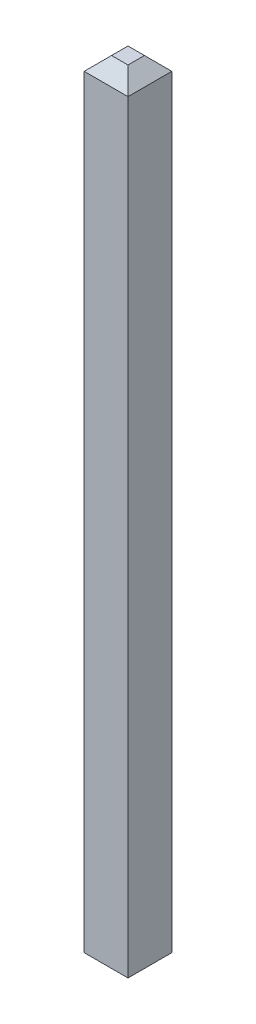
ISO-10303-21;
HEADER;
FILE_DESCRIPTION(('STEP AP214'),'2;1');
FILE_NAME('part.step','',(''),(''),'','','');
FILE_SCHEMA(('AUTOMOTIVE_DESIGN { 1 0 10303 214 1 1 1 1 }'));
ENDSEC;
DATA;
#1=APPLICATION_CONTEXT('core data for automotive mechanical design processes');
#2=APPLICATION_PROTOCOL_DEFINITION('international standard','automotive_design',2000,#1);
#3=PRODUCT_CONTEXT('',#1,'mechanical');
#4=PRODUCT('Part','Part','',(#3));
#5=PRODUCT_RELATED_PRODUCT_CATEGORY('part','',(#4));
#6=PRODUCT_DEFINITION_FORMATION('','',#4);
#7=PRODUCT_DEFINITION_CONTEXT('part definition',#1,'design');
#8=PRODUCT_DEFINITION('design','',#6,#7);
#9=PRODUCT_DEFINITION_SHAPE('','',#8);
#10=(LENGTH_UNIT() NAMED_UNIT(*) SI_UNIT(.MILLI.,.METRE.));
#11=(NAMED_UNIT(*) PLANE_ANGLE_UNIT() SI_UNIT($,.RADIAN.));
#12=(NAMED_UNIT(*) SI_UNIT($,.STERADIAN.) SOLID_ANGLE_UNIT());
#13=UNCERTAINTY_MEASURE_WITH_UNIT(LENGTH_MEASURE(1.E-05),#10,'distance_accuracy_value','');
#14=(GEOMETRIC_REPRESENTATION_CONTEXT(3) GLOBAL_UNCERTAINTY_ASSIGNED_CONTEXT((#13)) GLOBAL_UNIT_ASSIGNED_CONTEXT((#10,
#11,#12)) REPRESENTATION_CONTEXT('',''));
#15=CARTESIAN_POINT('',(0.,0.,0.));
#16=DIRECTION('',(0.,0.,1.));
#17=DIRECTION('',(1.,0.,0.));
#18=AXIS2_PLACEMENT_3D('',#15,#16,#17);
#19=CARTESIAN_POINT('',(-3.49,7.07,-0.32));
#20=DIRECTION('',(-0.707106781186548,-0.707106781186548,0.));
#21=DIRECTION('',(-0.707106781186548,0.707106781186548,0.));
#22=AXIS2_PLACEMENT_3D('',#19,#20,#21);
#23=PLANE('',#22);
#24=DIRECTION('',(0.577350269189626,-0.577350269189626,0.577350269189626));
#25=VECTOR('',#24,1.);
#26=CARTESIAN_POINT('',(-3.703333333333,7.283333333333,0.106666666667));
#27=LINE('',#26,#25);
#28=CARTESIAN_POINT('',(-3.69,7.27,0.12));
#29=VERTEX_POINT('',#28);
#30=CARTESIAN_POINT('',(-3.49,7.07,0.32));
#31=VERTEX_POINT('',#30);
#32=EDGE_CURVE('E85',#29,#31,#27,.T.);
#33=ORIENTED_EDGE('',*,*,#32,.T.);
#34=DIRECTION('',(0.,0.,1.));
#35=VECTOR('',#34,1.);
#36=CARTESIAN_POINT('',(-3.49,7.07,-0.32));
#37=LINE('',#36,#35);
#38=CARTESIAN_POINT('',(-3.49,7.07,-0.32));
#39=VERTEX_POINT('',#38);
#40=EDGE_CURVE('E113',#39,#31,#37,.T.);
#41=ORIENTED_EDGE('',*,*,#40,.F.);
#42=DIRECTION('',(0.577350269189626,-0.577350269189626,-0.577350269189626));
#43=VECTOR('',#42,1.);
#44=CARTESIAN_POINT('',(-3.49,7.07,-0.32));
#45=LINE('',#44,#43);
#46=CARTESIAN_POINT('',(-3.69,7.27,-0.12));
#47=VERTEX_POINT('',#46);
#48=EDGE_CURVE('E11',#47,#39,#45,.T.);
#49=ORIENTED_EDGE('',*,*,#48,.F.);
#50=DIRECTION('',(0.,0.,-1.));
#51=VECTOR('',#50,1.);
#52=CARTESIAN_POINT('',(-3.69,7.27,-0.32));
#53=LINE('',#52,#51);
#54=EDGE_CURVE('E117',#29,#47,#53,.T.);
#55=ORIENTED_EDGE('',*,*,#54,.F.);
#56=EDGE_LOOP('',(#33,#41,#49,#55));
#57=FACE_BOUND('',#56,.T.);
#58=ADVANCED_FACE('F16',(#57),#23,.F.);
#59=CARTESIAN_POINT('',(-3.81,7.07,-0.32));
#60=DIRECTION('',(0.,0.707106781186548,-0.707106781186548));
#61=DIRECTION('',(-1.,0.,0.));
#62=AXIS2_PLACEMENT_3D('',#59,#60,#61);
#63=PLANE('',#62);
#64=DIRECTION('',(0.577350269189626,0.577350269189626,0.577350269189626));
#65=VECTOR('',#64,1.);
#66=CARTESIAN_POINT('',(-3.996666666667,7.203333333333,-0.186666666667));
#67=LINE('',#66,#65);
#68=CARTESIAN_POINT('',(-4.13,7.07,-0.32));
#69=VERTEX_POINT('',#68);
#70=CARTESIAN_POINT('',(-3.93,7.27,-0.12));
#71=VERTEX_POINT('',#70);
#72=EDGE_CURVE('E26',#69,#71,#67,.T.);
#73=ORIENTED_EDGE('',*,*,#72,.T.);
#74=DIRECTION('',(-1.,0.,0.));
#75=VECTOR('',#74,1.);
#76=CARTESIAN_POINT('',(-4.13,7.27,-0.12));
#77=LINE('',#76,#75);
#78=EDGE_CURVE('E111',#47,#71,#77,.T.);
#79=ORIENTED_EDGE('',*,*,#78,.F.);
#80=ORIENTED_EDGE('',*,*,#48,.T.);
#81=DIRECTION('',(1.,0.,0.));
#82=VECTOR('',#81,1.);
#83=CARTESIAN_POINT('',(-3.49,7.07,-0.32));
#84=LINE('',#83,#82);
#85=EDGE_CURVE('E108',#69,#39,#84,.T.);
#86=ORIENTED_EDGE('',*,*,#85,.F.);
#87=EDGE_LOOP('',(#73,#79,#80,#86));
#88=FACE_BOUND('',#87,.T.);
#89=ADVANCED_FACE('F18',(#88),#63,.T.);
#90=CARTESIAN_POINT('',(-3.93,7.27,-0.32));
#91=DIRECTION('',(0.707106781186548,-0.707106781186548,0.));
#92=DIRECTION('',(0.,0.,-1.));
#93=AXIS2_PLACEMENT_3D('',#90,#91,#92);
#94=PLANE('',#93);
#95=DIRECTION('',(-0.577350269189626,-0.577350269189626,0.577350269189626));
#96=VECTOR('',#95,1.);
#97=CARTESIAN_POINT('',(-3.996666666667,7.203333333333,0.186666666667));
#98=LINE('',#97,#96);
#99=CARTESIAN_POINT('',(-3.93,7.27,0.12));
#100=VERTEX_POINT('',#99);
#101=CARTESIAN_POINT('',(-4.13,7.07,0.32));
#102=VERTEX_POINT('',#101);
#103=EDGE_CURVE('E39',#100,#102,#98,.T.);
#104=ORIENTED_EDGE('',*,*,#103,.F.);
#105=DIRECTION('',(0.,0.,1.));
#106=VECTOR('',#105,1.);
#107=CARTESIAN_POINT('',(-3.93,7.27,-0.32));
#108=LINE('',#107,#106);
#109=EDGE_CURVE('E167',#71,#100,#108,.T.);
#110=ORIENTED_EDGE('',*,*,#109,.F.);
#111=ORIENTED_EDGE('',*,*,#72,.F.);
#112=DIRECTION('',(0.,0.,-1.));
#113=VECTOR('',#112,1.);
#114=CARTESIAN_POINT('',(-4.13,7.07,-0.32));
#115=LINE('',#114,#113);
#116=EDGE_CURVE('E152',#102,#69,#115,.T.);
#117=ORIENTED_EDGE('',*,*,#116,.F.);
#118=EDGE_LOOP('',(#104,#110,#111,#117));
#119=FACE_BOUND('',#118,.T.);
#120=ADVANCED_FACE('F240',(#119),#94,.F.);
#121=CARTESIAN_POINT('',(-4.13,7.27,0.12));
#122=DIRECTION('',(0.,-0.707106781186548,-0.707106781186548));
#123=DIRECTION('',(0.,-0.707106781186548,0.707106781186548));
#124=AXIS2_PLACEMENT_3D('',#121,#122,#123);
#125=PLANE('',#124);
#126=ORIENTED_EDGE('',*,*,#32,.F.);
#127=DIRECTION('',(1.,0.,0.));
#128=VECTOR('',#127,1.);
#129=CARTESIAN_POINT('',(-4.13,7.27,0.12));
#130=LINE('',#129,#128);
#131=EDGE_CURVE('E155',#100,#29,#130,.T.);
#132=ORIENTED_EDGE('',*,*,#131,.F.);
#133=ORIENTED_EDGE('',*,*,#103,.T.);
#134=DIRECTION('',(-1.,0.,0.));
#135=VECTOR('',#134,1.);
#136=CARTESIAN_POINT('',(-3.81,7.07,0.32));
#137=LINE('',#136,#135);
#138=EDGE_CURVE('E118',#31,#102,#137,.T.);
#139=ORIENTED_EDGE('',*,*,#138,.F.);
#140=EDGE_LOOP('',(#126,#132,#133,#139));
#141=FACE_BOUND('',#140,.T.);
#142=ADVANCED_FACE('F300',(#141),#125,.F.);
#143=CARTESIAN_POINT('',(-4.13,7.27,-0.32));
#144=DIRECTION('',(0.,-1.,0.));
#145=DIRECTION('',(0.,0.,-1.));
#146=AXIS2_PLACEMENT_3D('',#143,#144,#145);
#147=PLANE('',#146);
#148=ORIENTED_EDGE('',*,*,#54,.T.);
#149=ORIENTED_EDGE('',*,*,#78,.T.);
#150=ORIENTED_EDGE('',*,*,#109,.T.);
#151=ORIENTED_EDGE('',*,*,#131,.T.);
#152=EDGE_LOOP('',(#148,#149,#150,#151));
#153=FACE_BOUND('',#152,.T.);
#154=ADVANCED_FACE('F296',(#153),#147,.F.);
#155=CARTESIAN_POINT('',(-3.49,7.27,-0.32));
#156=DIRECTION('',(-1.,0.,0.));
#157=DIRECTION('',(0.,1.,0.));
#158=AXIS2_PLACEMENT_3D('',#155,#156,#157);
#159=PLANE('',#158);
#160=DIRECTION('',(0.,-1.,0.));
#161=VECTOR('',#160,1.);
#162=CARTESIAN_POINT('',(-3.49,7.27,-0.32));
#163=LINE('',#162,#161);
#164=CARTESIAN_POINT('',(-3.49,-4.07,-0.32));
#165=VERTEX_POINT('',#164);
#166=EDGE_CURVE('E121',#39,#165,#163,.T.);
#167=ORIENTED_EDGE('',*,*,#166,.F.);
#168=ORIENTED_EDGE('',*,*,#40,.T.);
#169=DIRECTION('',(0.,-1.,0.));
#170=VECTOR('',#169,1.);
#171=CARTESIAN_POINT('',(-3.49,7.27,0.32));
#172=LINE('',#171,#170);
#173=CARTESIAN_POINT('',(-3.49,-4.07,0.32));
#174=VERTEX_POINT('',#173);
#175=EDGE_CURVE('E95',#31,#174,#172,.T.);
#176=ORIENTED_EDGE('',*,*,#175,.T.);
#177=DIRECTION('',(0.,0.,-1.));
#178=VECTOR('',#177,1.);
#179=CARTESIAN_POINT('',(-3.49,-4.07,-0.32));
#180=LINE('',#179,#178);
#181=EDGE_CURVE('E123',#174,#165,#180,.T.);
#182=ORIENTED_EDGE('',*,*,#181,.T.);
#183=EDGE_LOOP('',(#167,#168,#176,#182));
#184=FACE_BOUND('',#183,.T.);
#185=ADVANCED_FACE('F122',(#184),#159,.F.);
#186=CARTESIAN_POINT('',(-3.81,1.5,0.32));
#187=DIRECTION('',(0.,0.,-1.));
#188=DIRECTION('',(0.,-1.,0.));
#189=AXIS2_PLACEMENT_3D('',#186,#187,#188);
#190=PLANE('',#189);
#191=ORIENTED_EDGE('',*,*,#175,.F.);
#192=ORIENTED_EDGE('',*,*,#138,.T.);
#193=DIRECTION('',(0.,1.,0.));
#194=VECTOR('',#193,1.);
#195=CARTESIAN_POINT('',(-4.13,-4.27,0.32));
#196=LINE('',#195,#194);
#197=CARTESIAN_POINT('',(-4.13,-4.07,0.32));
#198=VERTEX_POINT('',#197);
#199=EDGE_CURVE('E128',#198,#102,#196,.T.);
#200=ORIENTED_EDGE('',*,*,#199,.F.);
#201=DIRECTION('',(1.,0.,0.));
#202=VECTOR('',#201,1.);
#203=CARTESIAN_POINT('',(-3.81,-4.07,0.32));
#204=LINE('',#203,#202);
#205=EDGE_CURVE('E198',#198,#174,#204,.T.);
#206=ORIENTED_EDGE('',*,*,#205,.T.);
#207=EDGE_LOOP('',(#191,#192,#200,#206));
#208=FACE_BOUND('',#207,.T.);
#209=ADVANCED_FACE('F259',(#208),#190,.F.);
#210=CARTESIAN_POINT('',(-3.69,-4.27,-0.32));
#211=DIRECTION('',(-0.707106781186548,0.707106781186548,0.));
#212=DIRECTION('',(0.,0.,1.));
#213=AXIS2_PLACEMENT_3D('',#210,#211,#212);
#214=PLANE('',#213);
#215=DIRECTION('',(-0.577350269189626,-0.577350269189626,0.577350269189626));
#216=VECTOR('',#215,1.);
#217=CARTESIAN_POINT('',(-3.623333333333,-4.203333333333,-0.186666666667));
#218=LINE('',#217,#216);
#219=CARTESIAN_POINT('',(-3.69,-4.27,-0.12));
#220=VERTEX_POINT('',#219);
#221=EDGE_CURVE('E139',#165,#220,#218,.T.);
#222=ORIENTED_EDGE('',*,*,#221,.F.);
#223=ORIENTED_EDGE('',*,*,#181,.F.);
#224=DIRECTION('',(-0.577350269189626,-0.577350269189626,-0.577350269189626));
#225=VECTOR('',#224,1.);
#226=CARTESIAN_POINT('',(-3.836666666667,-4.416666666667,-0.02666666666667));
#227=LINE('',#226,#225);
#228=CARTESIAN_POINT('',(-3.69,-4.27,0.12));
#229=VERTEX_POINT('',#228);
#230=EDGE_CURVE('E162',#174,#229,#227,.T.);
#231=ORIENTED_EDGE('',*,*,#230,.T.);
#232=DIRECTION('',(0.,0.,1.));
#233=VECTOR('',#232,1.);
#234=CARTESIAN_POINT('',(-3.69,-4.27,-0.32));
#235=LINE('',#234,#233);
#236=EDGE_CURVE('E173',#220,#229,#235,.T.);
#237=ORIENTED_EDGE('',*,*,#236,.F.);
#238=EDGE_LOOP('',(#222,#223,#231,#237));
#239=FACE_BOUND('',#238,.T.);
#240=ADVANCED_FACE('F219',(#239),#214,.F.);
#241=CARTESIAN_POINT('',(-3.49,-4.27,0.12));
#242=DIRECTION('',(0.,0.707106781186548,-0.707106781186548));
#243=DIRECTION('',(-1.,0.,0.));
#244=AXIS2_PLACEMENT_3D('',#241,#242,#243);
#245=PLANE('',#244);
#246=ORIENTED_EDGE('',*,*,#230,.F.);
#247=ORIENTED_EDGE('',*,*,#205,.F.);
#248=DIRECTION('',(-0.577350269189626,0.577350269189626,0.577350269189626));
#249=VECTOR('',#248,1.);
#250=CARTESIAN_POINT('',(-3.916666666667,-4.283333333333,0.106666666667));
#251=LINE('',#250,#249);
#252=CARTESIAN_POINT('',(-3.93,-4.27,0.12));
#253=VERTEX_POINT('',#252);
#254=EDGE_CURVE('E151',#253,#198,#251,.T.);
#255=ORIENTED_EDGE('',*,*,#254,.F.);
#256=DIRECTION('',(-1.,0.,0.));
#257=VECTOR('',#256,1.);
#258=CARTESIAN_POINT('',(-3.49,-4.27,0.12));
#259=LINE('',#258,#257);
#260=EDGE_CURVE('E168',#229,#253,#259,.T.);
#261=ORIENTED_EDGE('',*,*,#260,.F.);
#262=EDGE_LOOP('',(#246,#247,#255,#261));
#263=FACE_BOUND('',#262,.T.);
#264=ADVANCED_FACE('F224',(#263),#245,.F.);
#265=CARTESIAN_POINT('',(-4.13,-4.07,-0.32));
#266=DIRECTION('',(0.707106781186548,0.707106781186548,0.));
#267=DIRECTION('',(0.,0.,-1.));
#268=AXIS2_PLACEMENT_3D('',#265,#266,#267);
#269=PLANE('',#268);
#270=DIRECTION('',(0.577350269189626,-0.577350269189626,0.577350269189626));
#271=VECTOR('',#270,1.);
#272=CARTESIAN_POINT('',(-4.023333333333,-4.176666666667,-0.213333333333));
#273=LINE('',#272,#271);
#274=CARTESIAN_POINT('',(-4.13,-4.07,-0.32));
#275=VERTEX_POINT('',#274);
#276=CARTESIAN_POINT('',(-3.93,-4.27,-0.12));
#277=VERTEX_POINT('',#276);
#278=EDGE_CURVE('E174',#275,#277,#273,.T.);
#279=ORIENTED_EDGE('',*,*,#278,.T.);
#280=DIRECTION('',(0.,0.,-1.));
#281=VECTOR('',#280,1.);
#282=CARTESIAN_POINT('',(-3.93,-4.27,-0.32));
#283=LINE('',#282,#281);
#284=EDGE_CURVE('E172',#253,#277,#283,.T.);
#285=ORIENTED_EDGE('',*,*,#284,.F.);
#286=ORIENTED_EDGE('',*,*,#254,.T.);
#287=DIRECTION('',(0.,0.,1.));
#288=VECTOR('',#287,1.);
#289=CARTESIAN_POINT('',(-4.13,-4.07,-0.32));
#290=LINE('',#289,#288);
#291=EDGE_CURVE('E147',#275,#198,#290,.T.);
#292=ORIENTED_EDGE('',*,*,#291,.F.);
#293=EDGE_LOOP('',(#279,#285,#286,#292));
#294=FACE_BOUND('',#293,.T.);
#295=ADVANCED_FACE('F227',(#294),#269,.F.);
#296=CARTESIAN_POINT('',(-4.13,-4.27,-0.32));
#297=DIRECTION('',(1.,0.,0.));
#298=DIRECTION('',(0.,0.,1.));
#299=AXIS2_PLACEMENT_3D('',#296,#297,#298);
#300=PLANE('',#299);
#301=ORIENTED_EDGE('',*,*,#199,.T.);
#302=ORIENTED_EDGE('',*,*,#116,.T.);
#303=DIRECTION('',(0.,1.,0.));
#304=VECTOR('',#303,1.);
#305=CARTESIAN_POINT('',(-4.13,-4.27,-0.32));
#306=LINE('',#305,#304);
#307=EDGE_CURVE('E132',#275,#69,#306,.T.);
#308=ORIENTED_EDGE('',*,*,#307,.F.);
#309=ORIENTED_EDGE('',*,*,#291,.T.);
#310=EDGE_LOOP('',(#301,#302,#308,#309));
#311=FACE_BOUND('',#310,.T.);
#312=ADVANCED_FACE('F254',(#311),#300,.F.);
#313=CARTESIAN_POINT('',(-3.81,1.5,-0.32));
#314=DIRECTION('',(0.,0.,-1.));
#315=DIRECTION('',(0.,-1.,0.));
#316=AXIS2_PLACEMENT_3D('',#313,#314,#315);
#317=PLANE('',#316);
#318=ORIENTED_EDGE('',*,*,#307,.T.);
#319=ORIENTED_EDGE('',*,*,#85,.T.);
#320=ORIENTED_EDGE('',*,*,#166,.T.);
#321=DIRECTION('',(-1.,0.,0.));
#322=VECTOR('',#321,1.);
#323=CARTESIAN_POINT('',(-4.13,-4.07,-0.32));
#324=LINE('',#323,#322);
#325=EDGE_CURVE('E178',#165,#275,#324,.T.);
#326=ORIENTED_EDGE('',*,*,#325,.T.);
#327=EDGE_LOOP('',(#318,#319,#320,#326));
#328=FACE_BOUND('',#327,.T.);
#329=ADVANCED_FACE('F130',(#328),#317,.T.);
#330=CARTESIAN_POINT('',(-3.81,-4.07,-0.32));
#331=DIRECTION('',(0.,-0.707106781186548,-0.707106781186548));
#332=DIRECTION('',(0.,-0.707106781186548,0.707106781186548));
#333=AXIS2_PLACEMENT_3D('',#330,#331,#332);
#334=PLANE('',#333);
#335=ORIENTED_EDGE('',*,*,#278,.F.);
#336=ORIENTED_EDGE('',*,*,#325,.F.);
#337=ORIENTED_EDGE('',*,*,#221,.T.);
#338=DIRECTION('',(1.,0.,0.));
#339=VECTOR('',#338,1.);
#340=CARTESIAN_POINT('',(-3.49,-4.27,-0.12));
#341=LINE('',#340,#339);
#342=EDGE_CURVE('E179',#277,#220,#341,.T.);
#343=ORIENTED_EDGE('',*,*,#342,.F.);
#344=EDGE_LOOP('',(#335,#336,#337,#343));
#345=FACE_BOUND('',#344,.T.);
#346=ADVANCED_FACE('F228',(#345),#334,.T.);
#347=CARTESIAN_POINT('',(-3.49,-4.27,-0.32));
#348=DIRECTION('',(0.,1.,0.));
#349=DIRECTION('',(0.,0.,-1.));
#350=AXIS2_PLACEMENT_3D('',#347,#348,#349);
#351=PLANE('',#350);
#352=ORIENTED_EDGE('',*,*,#236,.T.);
#353=ORIENTED_EDGE('',*,*,#260,.T.);
#354=ORIENTED_EDGE('',*,*,#284,.T.);
#355=ORIENTED_EDGE('',*,*,#342,.T.);
#356=EDGE_LOOP('',(#352,#353,#354,#355));
#357=FACE_BOUND('',#356,.T.);
#358=ADVANCED_FACE('F214',(#357),#351,.F.);
#359=CLOSED_SHELL('',(#58,#89,#120,#142,#154,#185,#209,#240,#264,#295,#312,#329,#346,#358));
#360=MANIFOLD_SOLID_BREP('B1',#359);
#361=ADVANCED_BREP_SHAPE_REPRESENTATION('',(#18,#360),#14);
#362=SHAPE_DEFINITION_REPRESENTATION(#9,#361);
ENDSEC;
END-ISO-10303-21;
